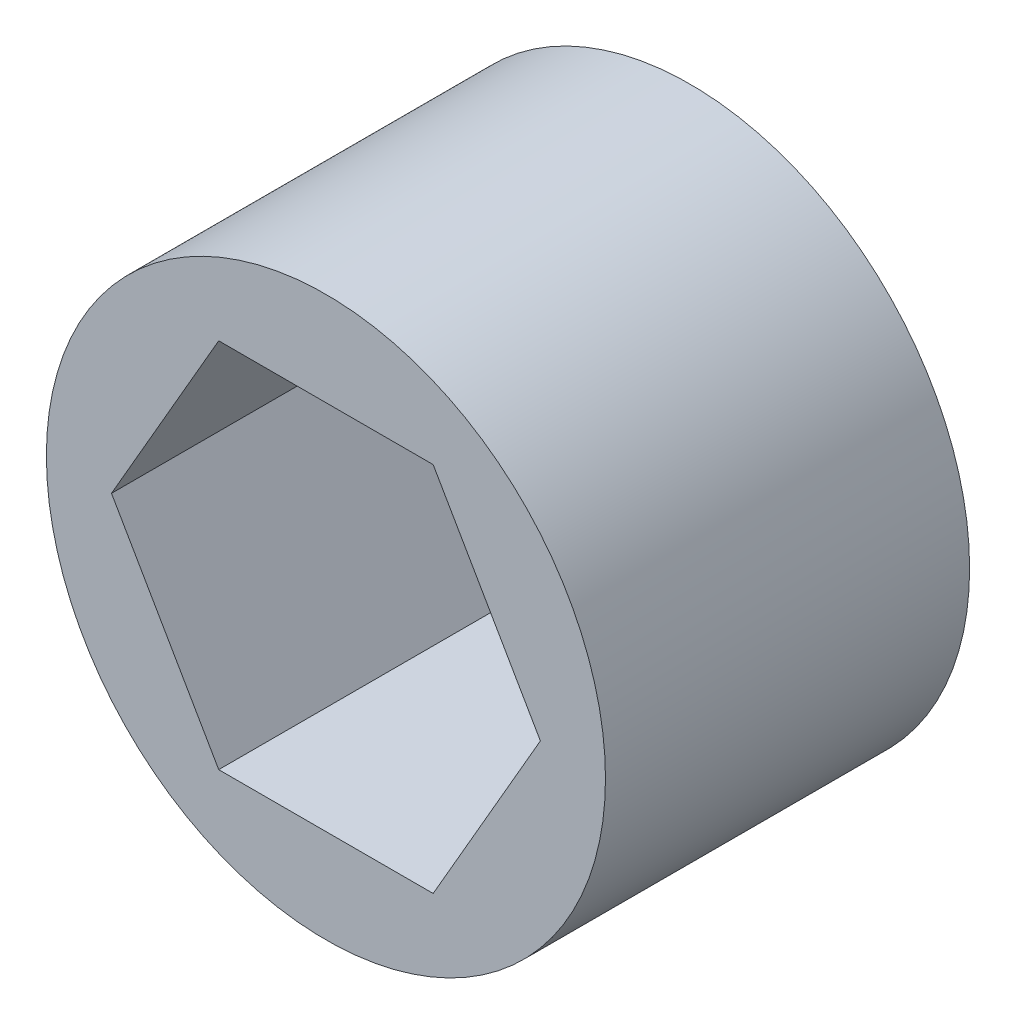
ISO-10303-21;
HEADER;
FILE_DESCRIPTION(('STEP AP214'),'2;1');
FILE_NAME('part.step','',(''),(''),'','','');
FILE_SCHEMA(('AUTOMOTIVE_DESIGN { 1 0 10303 214 1 1 1 1 }'));
ENDSEC;
DATA;
#1=APPLICATION_CONTEXT('core data for automotive mechanical design processes');
#2=APPLICATION_PROTOCOL_DEFINITION('international standard','automotive_design',2000,#1);
#3=PRODUCT_CONTEXT('',#1,'mechanical');
#4=PRODUCT('Part','Part','',(#3));
#5=PRODUCT_RELATED_PRODUCT_CATEGORY('part','',(#4));
#6=PRODUCT_DEFINITION_FORMATION('','',#4);
#7=PRODUCT_DEFINITION_CONTEXT('part definition',#1,'design');
#8=PRODUCT_DEFINITION('design','',#6,#7);
#9=PRODUCT_DEFINITION_SHAPE('','',#8);
#10=(LENGTH_UNIT() NAMED_UNIT(*) SI_UNIT(.MILLI.,.METRE.));
#11=(NAMED_UNIT(*) PLANE_ANGLE_UNIT() SI_UNIT($,.RADIAN.));
#12=(NAMED_UNIT(*) SI_UNIT($,.STERADIAN.) SOLID_ANGLE_UNIT());
#13=UNCERTAINTY_MEASURE_WITH_UNIT(LENGTH_MEASURE(1.E-05),#10,'distance_accuracy_value','');
#14=(GEOMETRIC_REPRESENTATION_CONTEXT(3) GLOBAL_UNCERTAINTY_ASSIGNED_CONTEXT((#13)) GLOBAL_UNIT_ASSIGNED_CONTEXT((#10,
#11,#12)) REPRESENTATION_CONTEXT('',''));
#15=CARTESIAN_POINT('',(0.,0.,0.));
#16=DIRECTION('',(0.,0.,1.));
#17=DIRECTION('',(1.,0.,0.));
#18=AXIS2_PLACEMENT_3D('',#15,#16,#17);
#19=CARTESIAN_POINT('',(-7.47899538708241,0.,6.35));
#20=DIRECTION('',(0.866025403784439,0.5,0.));
#21=DIRECTION('',(-0.5,0.866025403784439,0.));
#22=AXIS2_PLACEMENT_3D('',#19,#20,#21);
#23=PLANE('',#22);
#24=DIRECTION('',(-0.5,0.866025403784438,0.));
#25=VECTOR('',#24,1.);
#26=CARTESIAN_POINT('',(-3.73949769354121,-6.477,6.35));
#27=LINE('',#26,#25);
#28=CARTESIAN_POINT('',(-3.73949769354121,-6.477,6.35));
#29=VERTEX_POINT('',#28);
#30=CARTESIAN_POINT('',(-7.47899538708241,0.,6.35));
#31=VERTEX_POINT('',#30);
#32=EDGE_CURVE('E83',#29,#31,#27,.T.);
#33=ORIENTED_EDGE('',*,*,#32,.F.);
#34=DIRECTION('',(0.,0.,1.));
#35=VECTOR('',#34,1.);
#36=CARTESIAN_POINT('',(-3.73949769354121,-6.477,6.35));
#37=LINE('',#36,#35);
#38=CARTESIAN_POINT('',(-3.73949769354121,-6.477,-6.35));
#39=VERTEX_POINT('',#38);
#40=EDGE_CURVE('E75',#39,#29,#37,.T.);
#41=ORIENTED_EDGE('',*,*,#40,.F.);
#42=DIRECTION('',(-0.5,0.866025403784439,0.));
#43=VECTOR('',#42,1.);
#44=CARTESIAN_POINT('',(-3.73949769354121,-6.477,-6.35));
#45=LINE('',#44,#43);
#46=CARTESIAN_POINT('',(-7.47899538708241,0.,-6.35));
#47=VERTEX_POINT('',#46);
#48=EDGE_CURVE('E115',#39,#47,#45,.T.);
#49=ORIENTED_EDGE('',*,*,#48,.T.);
#50=DIRECTION('',(0.,0.,1.));
#51=VECTOR('',#50,1.);
#52=CARTESIAN_POINT('',(-7.47899538708241,0.,6.35));
#53=LINE('',#52,#51);
#54=EDGE_CURVE('E100',#31,#47,#53,.F.);
#55=ORIENTED_EDGE('',*,*,#54,.F.);
#56=EDGE_LOOP('',(#33,#41,#49,#55));
#57=FACE_BOUND('',#56,.T.);
#58=ADVANCED_FACE('F16',(#57),#23,.T.);
#59=CARTESIAN_POINT('',(-3.73949769354121,6.477,6.35));
#60=DIRECTION('',(0.866025403784439,-0.5,0.));
#61=DIRECTION('',(0.5,0.866025403784439,0.));
#62=AXIS2_PLACEMENT_3D('',#59,#60,#61);
#63=PLANE('',#62);
#64=DIRECTION('',(0.5,0.866025403784439,0.));
#65=VECTOR('',#64,1.);
#66=CARTESIAN_POINT('',(-7.47899538708242,0.,6.35));
#67=LINE('',#66,#65);
#68=CARTESIAN_POINT('',(-3.73949769354121,6.477,6.35));
#69=VERTEX_POINT('',#68);
#70=EDGE_CURVE('E108',#31,#69,#67,.T.);
#71=ORIENTED_EDGE('',*,*,#70,.F.);
#72=ORIENTED_EDGE('',*,*,#54,.T.);
#73=DIRECTION('',(0.5,0.866025403784439,0.));
#74=VECTOR('',#73,1.);
#75=CARTESIAN_POINT('',(-7.47899538708241,0.,-6.35));
#76=LINE('',#75,#74);
#77=CARTESIAN_POINT('',(-3.73949769354121,6.477,-6.35));
#78=VERTEX_POINT('',#77);
#79=EDGE_CURVE('E106',#47,#78,#76,.T.);
#80=ORIENTED_EDGE('',*,*,#79,.T.);
#81=DIRECTION('',(0.,0.,1.));
#82=VECTOR('',#81,1.);
#83=CARTESIAN_POINT('',(-3.73949769354121,6.477,6.35));
#84=LINE('',#83,#82);
#85=EDGE_CURVE('E97',#69,#78,#84,.F.);
#86=ORIENTED_EDGE('',*,*,#85,.F.);
#87=EDGE_LOOP('',(#71,#72,#80,#86));
#88=FACE_BOUND('',#87,.T.);
#89=ADVANCED_FACE('F105',(#88),#63,.T.);
#90=CARTESIAN_POINT('',(3.7394976935412,6.477,6.35));
#91=DIRECTION('',(0.,-1.,0.));
#92=DIRECTION('',(1.,0.,0.));
#93=AXIS2_PLACEMENT_3D('',#90,#91,#92);
#94=PLANE('',#93);
#95=DIRECTION('',(1.,0.,0.));
#96=VECTOR('',#95,1.);
#97=CARTESIAN_POINT('',(0.,6.477,6.35));
#98=LINE('',#97,#96);
#99=CARTESIAN_POINT('',(3.7394976935412,6.477,6.35));
#100=VERTEX_POINT('',#99);
#101=EDGE_CURVE('E125',#69,#100,#98,.T.);
#102=ORIENTED_EDGE('',*,*,#101,.F.);
#103=ORIENTED_EDGE('',*,*,#85,.T.);
#104=DIRECTION('',(1.,0.,0.));
#105=VECTOR('',#104,1.);
#106=CARTESIAN_POINT('',(0.,6.477,-6.35));
#107=LINE('',#106,#105);
#108=CARTESIAN_POINT('',(3.7394976935412,6.477,-6.35));
#109=VERTEX_POINT('',#108);
#110=EDGE_CURVE('E117',#78,#109,#107,.T.);
#111=ORIENTED_EDGE('',*,*,#110,.T.);
#112=DIRECTION('',(0.,0.,1.));
#113=VECTOR('',#112,1.);
#114=CARTESIAN_POINT('',(3.7394976935412,6.47700000000001,6.35));
#115=LINE('',#114,#113);
#116=EDGE_CURVE('E94',#100,#109,#115,.F.);
#117=ORIENTED_EDGE('',*,*,#116,.F.);
#118=EDGE_LOOP('',(#102,#103,#111,#117));
#119=FACE_BOUND('',#118,.T.);
#120=ADVANCED_FACE('F134',(#119),#94,.T.);
#121=CARTESIAN_POINT('',(7.47899538708241,0.,6.35));
#122=DIRECTION('',(-0.866025403784439,-0.5,0.));
#123=DIRECTION('',(0.5,-0.866025403784439,0.));
#124=AXIS2_PLACEMENT_3D('',#121,#122,#123);
#125=PLANE('',#124);
#126=DIRECTION('',(0.5,-0.866025403784438,0.));
#127=VECTOR('',#126,1.);
#128=CARTESIAN_POINT('',(3.7394976935412,6.477,6.35));
#129=LINE('',#128,#127);
#130=CARTESIAN_POINT('',(7.47899538708242,0.,6.35));
#131=VERTEX_POINT('',#130);
#132=EDGE_CURVE('E88',#100,#131,#129,.T.);
#133=ORIENTED_EDGE('',*,*,#132,.F.);
#134=ORIENTED_EDGE('',*,*,#116,.T.);
#135=DIRECTION('',(0.5,-0.866025403784438,0.));
#136=VECTOR('',#135,1.);
#137=CARTESIAN_POINT('',(3.7394976935412,6.477,-6.35));
#138=LINE('',#137,#136);
#139=CARTESIAN_POINT('',(7.47899538708241,0.,-6.35));
#140=VERTEX_POINT('',#139);
#141=EDGE_CURVE('E119',#109,#140,#138,.T.);
#142=ORIENTED_EDGE('',*,*,#141,.T.);
#143=DIRECTION('',(0.,0.,1.));
#144=VECTOR('',#143,1.);
#145=CARTESIAN_POINT('',(7.47899538708242,0.,6.35));
#146=LINE('',#145,#144);
#147=EDGE_CURVE('E64',#131,#140,#146,.F.);
#148=ORIENTED_EDGE('',*,*,#147,.F.);
#149=EDGE_LOOP('',(#133,#134,#142,#148));
#150=FACE_BOUND('',#149,.T.);
#151=ADVANCED_FACE('F131',(#150),#125,.T.);
#152=CARTESIAN_POINT('',(3.73949769354121,-6.477,6.35));
#153=DIRECTION('',(-0.866025403784439,0.5,0.));
#154=DIRECTION('',(-0.5,-0.866025403784439,0.));
#155=AXIS2_PLACEMENT_3D('',#152,#153,#154);
#156=PLANE('',#155);
#157=DIRECTION('',(-0.5,-0.866025403784439,0.));
#158=VECTOR('',#157,1.);
#159=CARTESIAN_POINT('',(7.47899538708241,0.,6.35));
#160=LINE('',#159,#158);
#161=CARTESIAN_POINT('',(3.73949769354121,-6.477,6.35));
#162=VERTEX_POINT('',#161);
#163=EDGE_CURVE('E70',#131,#162,#160,.T.);
#164=ORIENTED_EDGE('',*,*,#163,.F.);
#165=ORIENTED_EDGE('',*,*,#147,.T.);
#166=DIRECTION('',(-0.5,-0.866025403784439,0.));
#167=VECTOR('',#166,1.);
#168=CARTESIAN_POINT('',(7.47899538708241,0.,-6.35));
#169=LINE('',#168,#167);
#170=CARTESIAN_POINT('',(3.73949769354121,-6.477,-6.35));
#171=VERTEX_POINT('',#170);
#172=EDGE_CURVE('E32',#140,#171,#169,.T.);
#173=ORIENTED_EDGE('',*,*,#172,.T.);
#174=DIRECTION('',(0.,0.,1.));
#175=VECTOR('',#174,1.);
#176=CARTESIAN_POINT('',(3.73949769354121,-6.477,6.35));
#177=LINE('',#176,#175);
#178=EDGE_CURVE('E66',#162,#171,#177,.F.);
#179=ORIENTED_EDGE('',*,*,#178,.F.);
#180=EDGE_LOOP('',(#164,#165,#173,#179));
#181=FACE_BOUND('',#180,.T.);
#182=ADVANCED_FACE('F68',(#181),#156,.T.);
#183=CARTESIAN_POINT('',(-3.73949769354121,-6.477,6.35));
#184=DIRECTION('',(0.,1.,0.));
#185=DIRECTION('',(0.,0.,1.));
#186=AXIS2_PLACEMENT_3D('',#183,#184,#185);
#187=PLANE('',#186);
#188=DIRECTION('',(1.,0.,0.));
#189=VECTOR('',#188,1.);
#190=CARTESIAN_POINT('',(0.,-6.477,6.35));
#191=LINE('',#190,#189);
#192=EDGE_CURVE('E78',#162,#29,#191,.F.);
#193=ORIENTED_EDGE('',*,*,#192,.F.);
#194=ORIENTED_EDGE('',*,*,#178,.T.);
#195=DIRECTION('',(1.,0.,0.));
#196=VECTOR('',#195,1.);
#197=CARTESIAN_POINT('',(0.,-6.477,-6.35));
#198=LINE('',#197,#196);
#199=EDGE_CURVE('E127',#171,#39,#198,.F.);
#200=ORIENTED_EDGE('',*,*,#199,.T.);
#201=ORIENTED_EDGE('',*,*,#40,.T.);
#202=EDGE_LOOP('',(#193,#194,#200,#201));
#203=FACE_BOUND('',#202,.T.);
#204=ADVANCED_FACE('F79',(#203),#187,.T.);
#205=CARTESIAN_POINT('',(0.,0.,6.35));
#206=DIRECTION('',(0.,0.,1.));
#207=DIRECTION('',(1.,0.,0.));
#208=AXIS2_PLACEMENT_3D('',#205,#206,#207);
#209=PLANE('',#208);
#210=ORIENTED_EDGE('',*,*,#101,.T.);
#211=ORIENTED_EDGE('',*,*,#132,.T.);
#212=ORIENTED_EDGE('',*,*,#163,.T.);
#213=ORIENTED_EDGE('',*,*,#192,.T.);
#214=ORIENTED_EDGE('',*,*,#32,.T.);
#215=ORIENTED_EDGE('',*,*,#70,.T.);
#216=EDGE_LOOP('',(#210,#211,#212,#213,#214,#215));
#217=FACE_BOUND('',#216,.T.);
#218=CARTESIAN_POINT('',(0.,0.,6.35));
#219=DIRECTION('',(0.,0.,-1.));
#220=DIRECTION('',(-1.,0.,0.));
#221=AXIS2_PLACEMENT_3D('',#218,#219,#220);
#222=CIRCLE('',#221,9.75);
#223=CARTESIAN_POINT('',(-9.75,0.,6.35));
#224=VERTEX_POINT('',#223);
#225=EDGE_CURVE('E19',#224,#224,#222,.T.);
#226=ORIENTED_EDGE('',*,*,#225,.F.);
#227=EDGE_LOOP('',(#226));
#228=FACE_BOUND('',#227,.T.);
#229=ADVANCED_FACE('F86',(#217,#228),#209,.T.);
#230=CARTESIAN_POINT('',(0.,0.,-6.35));
#231=DIRECTION('',(0.,0.,1.));
#232=DIRECTION('',(1.,0.,0.));
#233=AXIS2_PLACEMENT_3D('',#230,#231,#232);
#234=PLANE('',#233);
#235=ORIENTED_EDGE('',*,*,#172,.F.);
#236=ORIENTED_EDGE('',*,*,#141,.F.);
#237=ORIENTED_EDGE('',*,*,#110,.F.);
#238=ORIENTED_EDGE('',*,*,#79,.F.);
#239=ORIENTED_EDGE('',*,*,#48,.F.);
#240=ORIENTED_EDGE('',*,*,#199,.F.);
#241=EDGE_LOOP('',(#235,#236,#237,#238,#239,#240));
#242=FACE_BOUND('',#241,.T.);
#243=CARTESIAN_POINT('',(0.,0.,-6.35));
#244=DIRECTION('',(0.,0.,-1.));
#245=DIRECTION('',(-1.,0.,0.));
#246=AXIS2_PLACEMENT_3D('',#243,#244,#245);
#247=CIRCLE('',#246,9.75);
#248=CARTESIAN_POINT('',(-9.75,0.,-6.35));
#249=VERTEX_POINT('',#248);
#250=EDGE_CURVE('E11',#249,#249,#247,.F.);
#251=ORIENTED_EDGE('',*,*,#250,.F.);
#252=EDGE_LOOP('',(#251));
#253=FACE_BOUND('',#252,.T.);
#254=ADVANCED_FACE('F113',(#242,#253),#234,.F.);
#255=CARTESIAN_POINT('',(0.,0.,6.35));
#256=DIRECTION('',(0.,0.,-1.));
#257=DIRECTION('',(-1.,0.,0.));
#258=AXIS2_PLACEMENT_3D('',#255,#256,#257);
#259=CYLINDRICAL_SURFACE('',#258,9.75);
#260=ORIENTED_EDGE('',*,*,#250,.T.);
#261=EDGE_LOOP('',(#260));
#262=FACE_BOUND('',#261,.T.);
#263=ORIENTED_EDGE('',*,*,#225,.T.);
#264=EDGE_LOOP('',(#263));
#265=FACE_BOUND('',#264,.T.);
#266=ADVANCED_FACE('F143',(#262,#265),#259,.T.);
#267=CLOSED_SHELL('',(#58,#89,#120,#151,#182,#204,#229,#254,#266));
#268=MANIFOLD_SOLID_BREP('B1',#267);
#269=ADVANCED_BREP_SHAPE_REPRESENTATION('',(#18,#268),#14);
#270=SHAPE_DEFINITION_REPRESENTATION(#9,#269);
ENDSEC;
END-ISO-10303-21;
